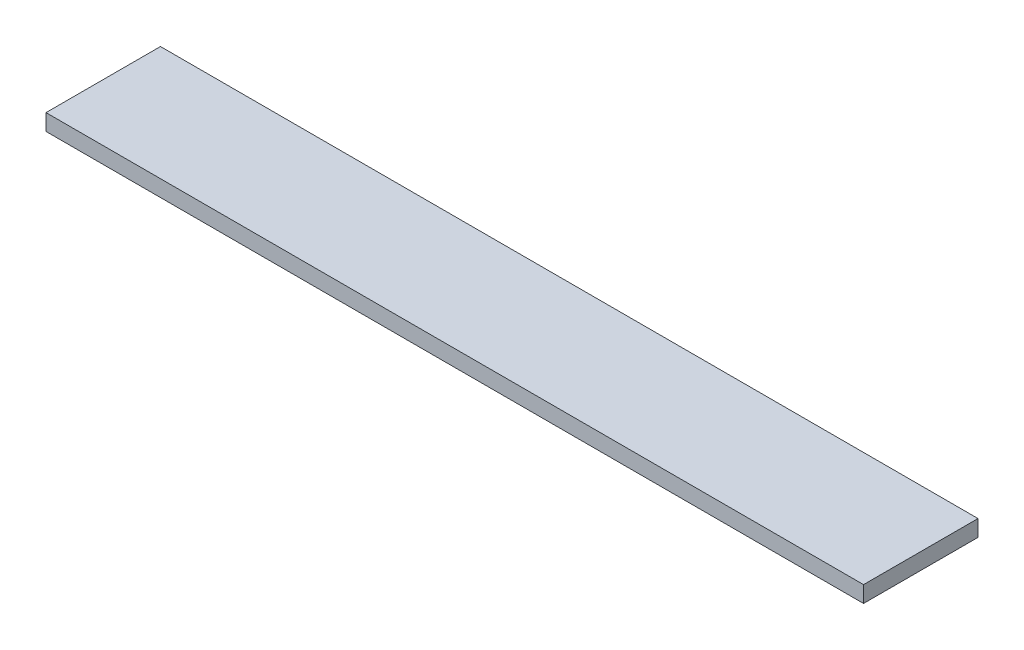
ISO-10303-21;
HEADER;
FILE_DESCRIPTION(('STEP AP214'),'2;1');
FILE_NAME('part.step','',(''),(''),'','','');
FILE_SCHEMA(('AUTOMOTIVE_DESIGN { 1 0 10303 214 1 1 1 1 }'));
ENDSEC;
DATA;
#1=APPLICATION_CONTEXT('core data for automotive mechanical design processes');
#2=APPLICATION_PROTOCOL_DEFINITION('international standard','automotive_design',2000,#1);
#3=PRODUCT_CONTEXT('',#1,'mechanical');
#4=PRODUCT('Part','Part','',(#3));
#5=PRODUCT_RELATED_PRODUCT_CATEGORY('part','',(#4));
#6=PRODUCT_DEFINITION_FORMATION('','',#4);
#7=PRODUCT_DEFINITION_CONTEXT('part definition',#1,'design');
#8=PRODUCT_DEFINITION('design','',#6,#7);
#9=PRODUCT_DEFINITION_SHAPE('','',#8);
#10=(LENGTH_UNIT() NAMED_UNIT(*) SI_UNIT(.MILLI.,.METRE.));
#11=(NAMED_UNIT(*) PLANE_ANGLE_UNIT() SI_UNIT($,.RADIAN.));
#12=(NAMED_UNIT(*) SI_UNIT($,.STERADIAN.) SOLID_ANGLE_UNIT());
#13=UNCERTAINTY_MEASURE_WITH_UNIT(LENGTH_MEASURE(1.E-05),#10,'distance_accuracy_value','');
#14=(GEOMETRIC_REPRESENTATION_CONTEXT(3) GLOBAL_UNCERTAINTY_ASSIGNED_CONTEXT((#13)) GLOBAL_UNIT_ASSIGNED_CONTEXT((#10,
#11,#12)) REPRESENTATION_CONTEXT('',''));
#15=CARTESIAN_POINT('',(0.,0.,0.));
#16=DIRECTION('',(0.,0.,1.));
#17=DIRECTION('',(1.,0.,0.));
#18=AXIS2_PLACEMENT_3D('',#15,#16,#17);
#19=CARTESIAN_POINT('',(250.,10.,35.));
#20=DIRECTION('',(-1.,0.,0.));
#21=DIRECTION('',(0.,0.,1.));
#22=AXIS2_PLACEMENT_3D('',#19,#20,#21);
#23=PLANE('',#22);
#24=DIRECTION('',(0.,0.,-1.));
#25=VECTOR('',#24,1.);
#26=CARTESIAN_POINT('',(250.,0.,35.));
#27=LINE('',#26,#25);
#28=CARTESIAN_POINT('',(250.,0.,35.));
#29=VERTEX_POINT('',#28);
#30=CARTESIAN_POINT('',(250.,0.,-35.));
#31=VERTEX_POINT('',#30);
#32=EDGE_CURVE('E98',#29,#31,#27,.T.);
#33=ORIENTED_EDGE('',*,*,#32,.T.);
#34=DIRECTION('',(0.,-1.,0.));
#35=VECTOR('',#34,1.);
#36=CARTESIAN_POINT('',(250.,10.,-35.));
#37=LINE('',#36,#35);
#38=CARTESIAN_POINT('',(250.,10.,-35.));
#39=VERTEX_POINT('',#38);
#40=EDGE_CURVE('E11',#39,#31,#37,.T.);
#41=ORIENTED_EDGE('',*,*,#40,.F.);
#42=DIRECTION('',(0.,0.,-1.));
#43=VECTOR('',#42,1.);
#44=CARTESIAN_POINT('',(250.,10.,35.));
#45=LINE('',#44,#43);
#46=CARTESIAN_POINT('',(250.,10.,35.));
#47=VERTEX_POINT('',#46);
#48=EDGE_CURVE('E86',#47,#39,#45,.T.);
#49=ORIENTED_EDGE('',*,*,#48,.F.);
#50=DIRECTION('',(0.,-1.,0.));
#51=VECTOR('',#50,1.);
#52=CARTESIAN_POINT('',(250.,10.,35.));
#53=LINE('',#52,#51);
#54=EDGE_CURVE('E94',#47,#29,#53,.T.);
#55=ORIENTED_EDGE('',*,*,#54,.T.);
#56=EDGE_LOOP('',(#33,#41,#49,#55));
#57=FACE_BOUND('',#56,.T.);
#58=ADVANCED_FACE('F35',(#57),#23,.F.);
#59=CARTESIAN_POINT('',(-250.,10.,-35.));
#60=DIRECTION('',(0.,0.,1.));
#61=DIRECTION('',(1.,0.,0.));
#62=AXIS2_PLACEMENT_3D('',#59,#60,#61);
#63=PLANE('',#62);
#64=DIRECTION('',(-1.,0.,0.));
#65=VECTOR('',#64,1.);
#66=CARTESIAN_POINT('',(-250.,0.,-35.));
#67=LINE('',#66,#65);
#68=CARTESIAN_POINT('',(-250.,0.,-35.));
#69=VERTEX_POINT('',#68);
#70=EDGE_CURVE('E90',#31,#69,#67,.T.);
#71=ORIENTED_EDGE('',*,*,#70,.T.);
#72=DIRECTION('',(0.,-1.,0.));
#73=VECTOR('',#72,1.);
#74=CARTESIAN_POINT('',(-250.,10.,-35.));
#75=LINE('',#74,#73);
#76=CARTESIAN_POINT('',(-250.,10.,-35.));
#77=VERTEX_POINT('',#76);
#78=EDGE_CURVE('E43',#77,#69,#75,.T.);
#79=ORIENTED_EDGE('',*,*,#78,.F.);
#80=DIRECTION('',(-1.,0.,0.));
#81=VECTOR('',#80,1.);
#82=CARTESIAN_POINT('',(-250.,10.,-35.));
#83=LINE('',#82,#81);
#84=EDGE_CURVE('E81',#39,#77,#83,.T.);
#85=ORIENTED_EDGE('',*,*,#84,.F.);
#86=ORIENTED_EDGE('',*,*,#40,.T.);
#87=EDGE_LOOP('',(#71,#79,#85,#86));
#88=FACE_BOUND('',#87,.T.);
#89=ADVANCED_FACE('F89',(#88),#63,.F.);
#90=CARTESIAN_POINT('',(-250.,10.,35.));
#91=DIRECTION('',(1.,0.,0.));
#92=DIRECTION('',(0.,0.,-1.));
#93=AXIS2_PLACEMENT_3D('',#90,#91,#92);
#94=PLANE('',#93);
#95=DIRECTION('',(0.,0.,1.));
#96=VECTOR('',#95,1.);
#97=CARTESIAN_POINT('',(-250.,0.,35.));
#98=LINE('',#97,#96);
#99=CARTESIAN_POINT('',(-250.,0.,35.));
#100=VERTEX_POINT('',#99);
#101=EDGE_CURVE('E68',#69,#100,#98,.T.);
#102=ORIENTED_EDGE('',*,*,#101,.T.);
#103=DIRECTION('',(0.,-1.,0.));
#104=VECTOR('',#103,1.);
#105=CARTESIAN_POINT('',(-250.,10.,35.));
#106=LINE('',#105,#104);
#107=CARTESIAN_POINT('',(-250.,10.,35.));
#108=VERTEX_POINT('',#107);
#109=EDGE_CURVE('E91',#108,#100,#106,.T.);
#110=ORIENTED_EDGE('',*,*,#109,.F.);
#111=DIRECTION('',(0.,0.,1.));
#112=VECTOR('',#111,1.);
#113=CARTESIAN_POINT('',(-250.,10.,35.));
#114=LINE('',#113,#112);
#115=EDGE_CURVE('E84',#77,#108,#114,.T.);
#116=ORIENTED_EDGE('',*,*,#115,.F.);
#117=ORIENTED_EDGE('',*,*,#78,.T.);
#118=EDGE_LOOP('',(#102,#110,#116,#117));
#119=FACE_BOUND('',#118,.T.);
#120=ADVANCED_FACE('F92',(#119),#94,.F.);
#121=CARTESIAN_POINT('',(-250.,10.,35.));
#122=DIRECTION('',(0.,0.,-1.));
#123=DIRECTION('',(-1.,0.,0.));
#124=AXIS2_PLACEMENT_3D('',#121,#122,#123);
#125=PLANE('',#124);
#126=DIRECTION('',(1.,0.,0.));
#127=VECTOR('',#126,1.);
#128=CARTESIAN_POINT('',(-250.,0.,35.));
#129=LINE('',#128,#127);
#130=EDGE_CURVE('E74',#100,#29,#129,.T.);
#131=ORIENTED_EDGE('',*,*,#130,.T.);
#132=ORIENTED_EDGE('',*,*,#54,.F.);
#133=DIRECTION('',(1.,0.,0.));
#134=VECTOR('',#133,1.);
#135=CARTESIAN_POINT('',(-250.,10.,35.));
#136=LINE('',#135,#134);
#137=EDGE_CURVE('E51',#108,#47,#136,.T.);
#138=ORIENTED_EDGE('',*,*,#137,.F.);
#139=ORIENTED_EDGE('',*,*,#109,.T.);
#140=EDGE_LOOP('',(#131,#132,#138,#139));
#141=FACE_BOUND('',#140,.T.);
#142=ADVANCED_FACE('F105',(#141),#125,.F.);
#143=CARTESIAN_POINT('',(0.,10.,0.));
#144=DIRECTION('',(0.,-1.,0.));
#145=DIRECTION('',(0.,0.,-1.));
#146=AXIS2_PLACEMENT_3D('',#143,#144,#145);
#147=PLANE('',#146);
#148=ORIENTED_EDGE('',*,*,#48,.T.);
#149=ORIENTED_EDGE('',*,*,#84,.T.);
#150=ORIENTED_EDGE('',*,*,#115,.T.);
#151=ORIENTED_EDGE('',*,*,#137,.T.);
#152=EDGE_LOOP('',(#148,#149,#150,#151));
#153=FACE_BOUND('',#152,.T.);
#154=ADVANCED_FACE('F82',(#153),#147,.F.);
#155=CARTESIAN_POINT('',(0.,0.,0.));
#156=DIRECTION('',(0.,-1.,0.));
#157=DIRECTION('',(0.,0.,-1.));
#158=AXIS2_PLACEMENT_3D('',#155,#156,#157);
#159=PLANE('',#158);
#160=ORIENTED_EDGE('',*,*,#32,.F.);
#161=ORIENTED_EDGE('',*,*,#130,.F.);
#162=ORIENTED_EDGE('',*,*,#101,.F.);
#163=ORIENTED_EDGE('',*,*,#70,.F.);
#164=EDGE_LOOP('',(#160,#161,#162,#163));
#165=FACE_BOUND('',#164,.T.);
#166=ADVANCED_FACE('F108',(#165),#159,.T.);
#167=CLOSED_SHELL('',(#58,#89,#120,#142,#154,#166));
#168=MANIFOLD_SOLID_BREP('B2',#167);
#169=ADVANCED_BREP_SHAPE_REPRESENTATION('',(#18,#168),#14);
#170=SHAPE_DEFINITION_REPRESENTATION(#9,#169);
ENDSEC;
END-ISO-10303-21;
